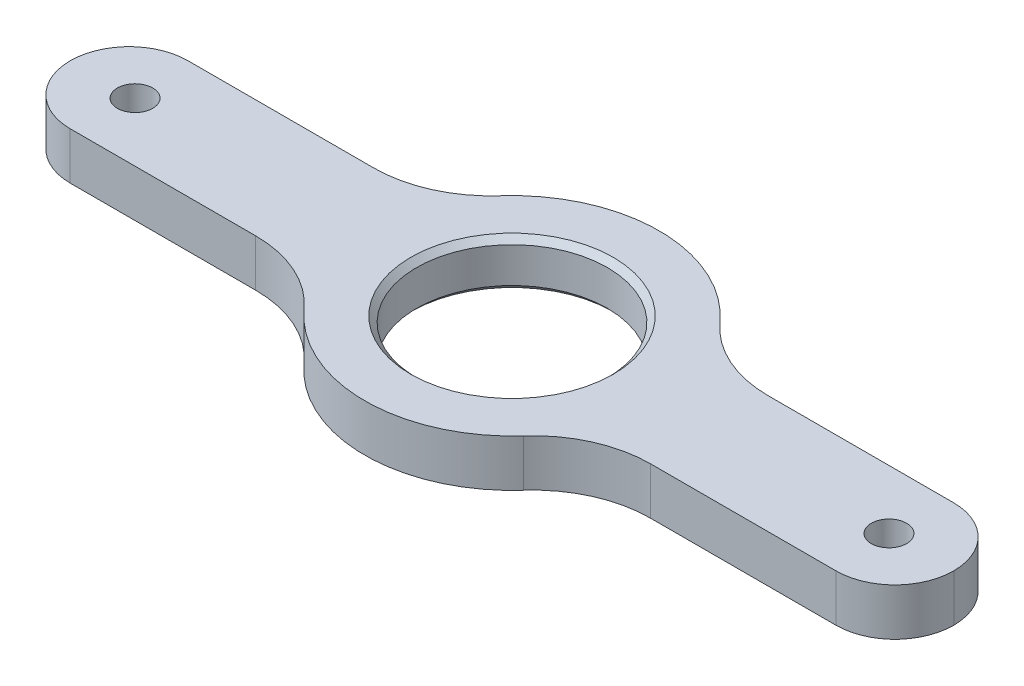
ISO-10303-21;
HEADER;
FILE_DESCRIPTION(('STEP AP214'),'2;1');
FILE_NAME('part.step','',(''),(''),'','','');
FILE_SCHEMA(('AUTOMOTIVE_DESIGN { 1 0 10303 214 1 1 1 1 }'));
ENDSEC;
DATA;
#1=APPLICATION_CONTEXT('core data for automotive mechanical design processes');
#2=APPLICATION_PROTOCOL_DEFINITION('international standard','automotive_design',2000,#1);
#3=PRODUCT_CONTEXT('',#1,'mechanical');
#4=PRODUCT('Part','Part','',(#3));
#5=PRODUCT_RELATED_PRODUCT_CATEGORY('part','',(#4));
#6=PRODUCT_DEFINITION_FORMATION('','',#4);
#7=PRODUCT_DEFINITION_CONTEXT('part definition',#1,'design');
#8=PRODUCT_DEFINITION('design','',#6,#7);
#9=PRODUCT_DEFINITION_SHAPE('','',#8);
#10=(LENGTH_UNIT() NAMED_UNIT(*) SI_UNIT(.MILLI.,.METRE.));
#11=(NAMED_UNIT(*) PLANE_ANGLE_UNIT() SI_UNIT($,.RADIAN.));
#12=(NAMED_UNIT(*) SI_UNIT($,.STERADIAN.) SOLID_ANGLE_UNIT());
#13=UNCERTAINTY_MEASURE_WITH_UNIT(LENGTH_MEASURE(1.E-05),#10,'distance_accuracy_value','');
#14=(GEOMETRIC_REPRESENTATION_CONTEXT(3) GLOBAL_UNCERTAINTY_ASSIGNED_CONTEXT((#13)) GLOBAL_UNIT_ASSIGNED_CONTEXT((#10,
#11,#12)) REPRESENTATION_CONTEXT('',''));
#15=CARTESIAN_POINT('',(0.,0.,0.));
#16=DIRECTION('',(0.,0.,1.));
#17=DIRECTION('',(1.,0.,0.));
#18=AXIS2_PLACEMENT_3D('',#15,#16,#17);
#19=CARTESIAN_POINT('',(-37.5,4.,-5.));
#20=DIRECTION('',(0.,0.,1.));
#21=DIRECTION('',(1.,0.,0.));
#22=AXIS2_PLACEMENT_3D('',#19,#20,#21);
#23=PLANE('',#22);
#24=DIRECTION('',(-1.,0.,0.));
#25=VECTOR('',#24,1.);
#26=CARTESIAN_POINT('',(-37.5,4.,-5.));
#27=LINE('',#26,#25);
#28=CARTESIAN_POINT('',(32.5,4.,-5.));
#29=VERTEX_POINT('',#28);
#30=CARTESIAN_POINT('',(16.7705098312484,4.,-5.));
#31=VERTEX_POINT('',#30);
#32=EDGE_CURVE('E163',#29,#31,#27,.T.);
#33=ORIENTED_EDGE('',*,*,#32,.F.);
#34=DIRECTION('',(0.,-1.,0.));
#35=VECTOR('',#34,1.);
#36=CARTESIAN_POINT('',(32.5,4.,-5.));
#37=LINE('',#36,#35);
#38=CARTESIAN_POINT('',(32.5,0.,-5.));
#39=VERTEX_POINT('',#38);
#40=EDGE_CURVE('E218',#29,#39,#37,.T.);
#41=ORIENTED_EDGE('',*,*,#40,.T.);
#42=DIRECTION('',(-1.,0.,0.));
#43=VECTOR('',#42,1.);
#44=CARTESIAN_POINT('',(-37.5,0.,-5.));
#45=LINE('',#44,#43);
#46=CARTESIAN_POINT('',(16.7705098312484,0.,-5.));
#47=VERTEX_POINT('',#46);
#48=EDGE_CURVE('E274',#39,#47,#45,.T.);
#49=ORIENTED_EDGE('',*,*,#48,.T.);
#50=DIRECTION('',(0.,1.,0.));
#51=VECTOR('',#50,1.);
#52=CARTESIAN_POINT('',(16.7705098312484,4.,-5.));
#53=LINE('',#52,#51);
#54=EDGE_CURVE('E178',#47,#31,#53,.T.);
#55=ORIENTED_EDGE('',*,*,#54,.T.);
#56=EDGE_LOOP('',(#33,#41,#49,#55));
#57=FACE_BOUND('',#56,.T.);
#58=ADVANCED_FACE('F39',(#57),#23,.F.);
#59=CARTESIAN_POINT('',(-37.5,4.,5.));
#60=DIRECTION('',(0.,0.,-1.));
#61=DIRECTION('',(-1.,0.,0.));
#62=AXIS2_PLACEMENT_3D('',#59,#60,#61);
#63=PLANE('',#62);
#64=DIRECTION('',(1.,0.,0.));
#65=VECTOR('',#64,1.);
#66=CARTESIAN_POINT('',(-37.5,4.,5.));
#67=LINE('',#66,#65);
#68=CARTESIAN_POINT('',(-32.5,4.,5.));
#69=VERTEX_POINT('',#68);
#70=CARTESIAN_POINT('',(-16.7705098312484,4.,5.));
#71=VERTEX_POINT('',#70);
#72=EDGE_CURVE('E162',#69,#71,#67,.T.);
#73=ORIENTED_EDGE('',*,*,#72,.F.);
#74=DIRECTION('',(0.,-1.,0.));
#75=VECTOR('',#74,1.);
#76=CARTESIAN_POINT('',(-32.5,4.,5.));
#77=LINE('',#76,#75);
#78=CARTESIAN_POINT('',(-32.5,0.,5.));
#79=VERTEX_POINT('',#78);
#80=EDGE_CURVE('E222',#69,#79,#77,.T.);
#81=ORIENTED_EDGE('',*,*,#80,.T.);
#82=DIRECTION('',(1.,0.,0.));
#83=VECTOR('',#82,1.);
#84=CARTESIAN_POINT('',(-37.5,0.,5.));
#85=LINE('',#84,#83);
#86=CARTESIAN_POINT('',(-16.7705098312484,0.,5.));
#87=VERTEX_POINT('',#86);
#88=EDGE_CURVE('E171',#79,#87,#85,.T.);
#89=ORIENTED_EDGE('',*,*,#88,.T.);
#90=DIRECTION('',(0.,1.,0.));
#91=VECTOR('',#90,1.);
#92=CARTESIAN_POINT('',(-16.7705098312484,4.,5.));
#93=LINE('',#92,#91);
#94=EDGE_CURVE('E175',#87,#71,#93,.T.);
#95=ORIENTED_EDGE('',*,*,#94,.T.);
#96=EDGE_LOOP('',(#73,#81,#89,#95));
#97=FACE_BOUND('',#96,.T.);
#98=ADVANCED_FACE('F337',(#97),#63,.F.);
#99=CARTESIAN_POINT('',(-16.7705098312484,0.,-5.));
#100=VERTEX_POINT('',#99);
#101=CARTESIAN_POINT('',(-32.5,0.,-5.));
#102=VERTEX_POINT('',#101);
#103=EDGE_CURVE('E291',#100,#102,#45,.T.);
#104=ORIENTED_EDGE('',*,*,#103,.T.);
#105=DIRECTION('',(0.,-1.,0.));
#106=VECTOR('',#105,1.);
#107=CARTESIAN_POINT('',(-32.5,4.,-5.));
#108=LINE('',#107,#106);
#109=CARTESIAN_POINT('',(-32.5,4.,-5.));
#110=VERTEX_POINT('',#109);
#111=EDGE_CURVE('E220',#102,#110,#108,.F.);
#112=ORIENTED_EDGE('',*,*,#111,.T.);
#113=CARTESIAN_POINT('',(-16.7705098312484,4.,-5.));
#114=VERTEX_POINT('',#113);
#115=EDGE_CURVE('E285',#114,#110,#27,.T.);
#116=ORIENTED_EDGE('',*,*,#115,.F.);
#117=DIRECTION('',(0.,1.,0.));
#118=VECTOR('',#117,1.);
#119=CARTESIAN_POINT('',(-16.7705098312484,4.,-5.));
#120=LINE('',#119,#118);
#121=EDGE_CURVE('E185',#114,#100,#120,.F.);
#122=ORIENTED_EDGE('',*,*,#121,.T.);
#123=EDGE_LOOP('',(#104,#112,#116,#122));
#124=FACE_BOUND('',#123,.T.);
#125=ADVANCED_FACE('F339',(#124),#23,.F.);
#126=CARTESIAN_POINT('',(16.7705098312484,0.,5.));
#127=VERTEX_POINT('',#126);
#128=CARTESIAN_POINT('',(32.5,0.,5.));
#129=VERTEX_POINT('',#128);
#130=EDGE_CURVE('E290',#127,#129,#85,.T.);
#131=ORIENTED_EDGE('',*,*,#130,.T.);
#132=DIRECTION('',(0.,-1.,0.));
#133=VECTOR('',#132,1.);
#134=CARTESIAN_POINT('',(32.5,4.,5.));
#135=LINE('',#134,#133);
#136=CARTESIAN_POINT('',(32.5,4.,5.));
#137=VERTEX_POINT('',#136);
#138=EDGE_CURVE('E161',#129,#137,#135,.F.);
#139=ORIENTED_EDGE('',*,*,#138,.T.);
#140=CARTESIAN_POINT('',(16.7705098312484,4.,5.));
#141=VERTEX_POINT('',#140);
#142=EDGE_CURVE('E144',#141,#137,#67,.T.);
#143=ORIENTED_EDGE('',*,*,#142,.F.);
#144=DIRECTION('',(0.,1.,0.));
#145=VECTOR('',#144,1.);
#146=CARTESIAN_POINT('',(16.7705098312484,4.,5.));
#147=LINE('',#146,#145);
#148=EDGE_CURVE('E158',#141,#127,#147,.F.);
#149=ORIENTED_EDGE('',*,*,#148,.T.);
#150=EDGE_LOOP('',(#131,#139,#143,#149));
#151=FACE_BOUND('',#150,.T.);
#152=ADVANCED_FACE('F157',(#151),#63,.F.);
#153=CARTESIAN_POINT('',(0.,4.,0.));
#154=DIRECTION('',(0.,-1.,0.));
#155=DIRECTION('',(0.,0.,-1.));
#156=AXIS2_PLACEMENT_3D('',#153,#154,#155);
#157=PLANE('',#156);
#158=CARTESIAN_POINT('',(0.,4.,0.));
#159=DIRECTION('',(0.,-1.,0.));
#160=DIRECTION('',(0.,0.,-1.));
#161=AXIS2_PLACEMENT_3D('',#158,#159,#160);
#162=CIRCLE('',#161,8.60000000000002);
#163=CARTESIAN_POINT('',(0.,4.,-8.60000000000002));
#164=VERTEX_POINT('',#163);
#165=EDGE_CURVE('E48',#164,#164,#162,.T.);
#166=ORIENTED_EDGE('',*,*,#165,.T.);
#167=EDGE_LOOP('',(#166));
#168=FACE_BOUND('',#167,.T.);
#169=CARTESIAN_POINT('',(32.,4.,0.));
#170=DIRECTION('',(0.,-1.,0.));
#171=DIRECTION('',(0.,0.,1.));
#172=AXIS2_PLACEMENT_3D('',#169,#170,#171);
#173=CIRCLE('',#172,1.5);
#174=CARTESIAN_POINT('',(32.,4.,1.5));
#175=VERTEX_POINT('',#174);
#176=EDGE_CURVE('E228',#175,#175,#173,.T.);
#177=ORIENTED_EDGE('',*,*,#176,.T.);
#178=EDGE_LOOP('',(#177));
#179=FACE_BOUND('',#178,.T.);
#180=CARTESIAN_POINT('',(-32.,4.,0.));
#181=DIRECTION('',(0.,1.,0.));
#182=DIRECTION('',(0.,0.,1.));
#183=AXIS2_PLACEMENT_3D('',#180,#181,#182);
#184=CIRCLE('',#183,1.5);
#185=CARTESIAN_POINT('',(-32.,4.,1.5));
#186=VERTEX_POINT('',#185);
#187=EDGE_CURVE('E308',#186,#186,#184,.T.);
#188=ORIENTED_EDGE('',*,*,#187,.F.);
#189=EDGE_LOOP('',(#188));
#190=FACE_BOUND('',#189,.T.);
#191=ORIENTED_EDGE('',*,*,#142,.T.);
#192=CARTESIAN_POINT('',(32.5,4.,0.));
#193=DIRECTION('',(0.,-1.,0.));
#194=DIRECTION('',(0.,0.,-1.));
#195=AXIS2_PLACEMENT_3D('',#192,#193,#194);
#196=CIRCLE('',#195,5.);
#197=CARTESIAN_POINT('',(37.5,4.,0.));
#198=VERTEX_POINT('',#197);
#199=EDGE_CURVE('E216',#137,#198,#196,.F.);
#200=ORIENTED_EDGE('',*,*,#199,.T.);
#201=CARTESIAN_POINT('',(32.5,4.,0.));
#202=DIRECTION('',(0.,-1.,0.));
#203=DIRECTION('',(0.,0.,-1.));
#204=AXIS2_PLACEMENT_3D('',#201,#202,#203);
#205=CIRCLE('',#204,5.);
#206=EDGE_CURVE('E214',#198,#29,#205,.F.);
#207=ORIENTED_EDGE('',*,*,#206,.T.);
#208=ORIENTED_EDGE('',*,*,#32,.T.);
#209=CARTESIAN_POINT('',(16.7705098312484,4.,-15.));
#210=DIRECTION('',(0.,-1.,0.));
#211=DIRECTION('',(0.,0.,-1.));
#212=AXIS2_PLACEMENT_3D('',#209,#210,#211);
#213=CIRCLE('',#212,10.);
#214=CARTESIAN_POINT('',(9.31694990624912,4.,-8.33333333333334));
#215=VERTEX_POINT('',#214);
#216=EDGE_CURVE('E193',#31,#215,#213,.T.);
#217=ORIENTED_EDGE('',*,*,#216,.T.);
#218=CARTESIAN_POINT('',(0.,4.,0.));
#219=DIRECTION('',(0.,1.,0.));
#220=DIRECTION('',(0.,0.,1.));
#221=AXIS2_PLACEMENT_3D('',#218,#219,#220);
#222=CIRCLE('',#221,12.5);
#223=CARTESIAN_POINT('',(-9.31694990624912,4.,-8.33333333333334));
#224=VERTEX_POINT('',#223);
#225=EDGE_CURVE('E300',#215,#224,#222,.T.);
#226=ORIENTED_EDGE('',*,*,#225,.T.);
#227=CARTESIAN_POINT('',(-16.7705098312484,4.,-15.));
#228=DIRECTION('',(0.,-1.,0.));
#229=DIRECTION('',(0.,0.,-1.));
#230=AXIS2_PLACEMENT_3D('',#227,#228,#229);
#231=CIRCLE('',#230,10.);
#232=EDGE_CURVE('E200',#224,#114,#231,.T.);
#233=ORIENTED_EDGE('',*,*,#232,.T.);
#234=ORIENTED_EDGE('',*,*,#115,.T.);
#235=CARTESIAN_POINT('',(-32.5,4.,0.));
#236=DIRECTION('',(0.,-1.,0.));
#237=DIRECTION('',(0.,0.,-1.));
#238=AXIS2_PLACEMENT_3D('',#235,#236,#237);
#239=CIRCLE('',#238,5.);
#240=CARTESIAN_POINT('',(-37.5,4.,0.));
#241=VERTEX_POINT('',#240);
#242=EDGE_CURVE('E55',#110,#241,#239,.F.);
#243=ORIENTED_EDGE('',*,*,#242,.T.);
#244=CARTESIAN_POINT('',(-32.5,4.,0.));
#245=DIRECTION('',(0.,-1.,0.));
#246=DIRECTION('',(0.,0.,-1.));
#247=AXIS2_PLACEMENT_3D('',#244,#245,#246);
#248=CIRCLE('',#247,5.);
#249=EDGE_CURVE('E211',#241,#69,#248,.F.);
#250=ORIENTED_EDGE('',*,*,#249,.T.);
#251=ORIENTED_EDGE('',*,*,#72,.T.);
#252=CARTESIAN_POINT('',(-16.7705098312484,4.,15.));
#253=DIRECTION('',(0.,-1.,0.));
#254=DIRECTION('',(0.,0.,-1.));
#255=AXIS2_PLACEMENT_3D('',#252,#253,#254);
#256=CIRCLE('',#255,10.);
#257=CARTESIAN_POINT('',(-9.31694990624913,4.,8.33333333333333));
#258=VERTEX_POINT('',#257);
#259=EDGE_CURVE('E150',#71,#258,#256,.T.);
#260=ORIENTED_EDGE('',*,*,#259,.T.);
#261=CARTESIAN_POINT('',(9.31694990624913,4.,8.33333333333333));
#262=VERTEX_POINT('',#261);
#263=EDGE_CURVE('E146',#258,#262,#222,.T.);
#264=ORIENTED_EDGE('',*,*,#263,.T.);
#265=CARTESIAN_POINT('',(16.7705098312484,4.,15.));
#266=DIRECTION('',(0.,-1.,0.));
#267=DIRECTION('',(0.,0.,-1.));
#268=AXIS2_PLACEMENT_3D('',#265,#266,#267);
#269=CIRCLE('',#268,10.);
#270=EDGE_CURVE('E141',#262,#141,#269,.T.);
#271=ORIENTED_EDGE('',*,*,#270,.T.);
#272=EDGE_LOOP('',(#191,#200,#207,#208,#217,#226,#233,#234,#243,#250,#251,#260,#264,#271));
#273=FACE_BOUND('',#272,.T.);
#274=ADVANCED_FACE('F143',(#168,#179,#190,#273),#157,.F.);
#275=CARTESIAN_POINT('',(0.,0.,0.));
#276=DIRECTION('',(0.,-1.,0.));
#277=DIRECTION('',(0.,0.,-1.));
#278=AXIS2_PLACEMENT_3D('',#275,#276,#277);
#279=PLANE('',#278);
#280=CARTESIAN_POINT('',(0.,0.,0.));
#281=DIRECTION('',(0.,-1.,0.));
#282=DIRECTION('',(0.,0.,-1.));
#283=AXIS2_PLACEMENT_3D('',#280,#281,#282);
#284=CIRCLE('',#283,8.60000000000001);
#285=CARTESIAN_POINT('',(0.,0.,-8.60000000000001));
#286=VERTEX_POINT('',#285);
#287=EDGE_CURVE('E11',#286,#286,#284,.F.);
#288=ORIENTED_EDGE('',*,*,#287,.T.);
#289=EDGE_LOOP('',(#288));
#290=FACE_BOUND('',#289,.T.);
#291=CARTESIAN_POINT('',(32.,0.,0.));
#292=DIRECTION('',(0.,-1.,0.));
#293=DIRECTION('',(0.,0.,1.));
#294=AXIS2_PLACEMENT_3D('',#291,#292,#293);
#295=CIRCLE('',#294,1.5);
#296=CARTESIAN_POINT('',(32.,0.,1.5));
#297=VERTEX_POINT('',#296);
#298=EDGE_CURVE('E265',#297,#297,#295,.T.);
#299=ORIENTED_EDGE('',*,*,#298,.F.);
#300=EDGE_LOOP('',(#299));
#301=FACE_BOUND('',#300,.T.);
#302=CARTESIAN_POINT('',(-32.,0.,0.));
#303=DIRECTION('',(0.,1.,0.));
#304=DIRECTION('',(0.,0.,1.));
#305=AXIS2_PLACEMENT_3D('',#302,#303,#304);
#306=CIRCLE('',#305,1.5);
#307=CARTESIAN_POINT('',(-32.,0.,1.5));
#308=VERTEX_POINT('',#307);
#309=EDGE_CURVE('E269',#308,#308,#306,.T.);
#310=ORIENTED_EDGE('',*,*,#309,.T.);
#311=EDGE_LOOP('',(#310));
#312=FACE_BOUND('',#311,.T.);
#313=CARTESIAN_POINT('',(32.5,0.,0.));
#314=DIRECTION('',(0.,-1.,0.));
#315=DIRECTION('',(0.,0.,-1.));
#316=AXIS2_PLACEMENT_3D('',#313,#314,#315);
#317=CIRCLE('',#316,5.);
#318=CARTESIAN_POINT('',(37.5,0.,0.));
#319=VERTEX_POINT('',#318);
#320=EDGE_CURVE('E206',#39,#319,#317,.T.);
#321=ORIENTED_EDGE('',*,*,#320,.T.);
#322=CARTESIAN_POINT('',(32.5,0.,0.));
#323=DIRECTION('',(0.,-1.,0.));
#324=DIRECTION('',(0.,0.,-1.));
#325=AXIS2_PLACEMENT_3D('',#322,#323,#324);
#326=CIRCLE('',#325,5.);
#327=EDGE_CURVE('E208',#319,#129,#326,.T.);
#328=ORIENTED_EDGE('',*,*,#327,.T.);
#329=ORIENTED_EDGE('',*,*,#130,.F.);
#330=CARTESIAN_POINT('',(16.7705098312484,0.,15.));
#331=DIRECTION('',(0.,-1.,0.));
#332=DIRECTION('',(0.,0.,-1.));
#333=AXIS2_PLACEMENT_3D('',#330,#331,#332);
#334=CIRCLE('',#333,10.);
#335=CARTESIAN_POINT('',(9.31694990624913,0.,8.33333333333333));
#336=VERTEX_POINT('',#335);
#337=EDGE_CURVE('E151',#127,#336,#334,.F.);
#338=ORIENTED_EDGE('',*,*,#337,.T.);
#339=CARTESIAN_POINT('',(0.,0.,0.));
#340=DIRECTION('',(0.,-1.,0.));
#341=DIRECTION('',(0.,0.,-1.));
#342=AXIS2_PLACEMENT_3D('',#339,#340,#341);
#343=CIRCLE('',#342,12.5);
#344=CARTESIAN_POINT('',(-9.31694990624913,0.,8.33333333333333));
#345=VERTEX_POINT('',#344);
#346=EDGE_CURVE('E293',#345,#336,#343,.F.);
#347=ORIENTED_EDGE('',*,*,#346,.F.);
#348=CARTESIAN_POINT('',(-16.7705098312484,0.,15.));
#349=DIRECTION('',(0.,-1.,0.));
#350=DIRECTION('',(0.,0.,-1.));
#351=AXIS2_PLACEMENT_3D('',#348,#349,#350);
#352=CIRCLE('',#351,10.);
#353=EDGE_CURVE('E190',#345,#87,#352,.F.);
#354=ORIENTED_EDGE('',*,*,#353,.T.);
#355=ORIENTED_EDGE('',*,*,#88,.F.);
#356=CARTESIAN_POINT('',(-32.5,0.,0.));
#357=DIRECTION('',(0.,-1.,0.));
#358=DIRECTION('',(0.,0.,-1.));
#359=AXIS2_PLACEMENT_3D('',#356,#357,#358);
#360=CIRCLE('',#359,5.);
#361=CARTESIAN_POINT('',(-37.5,0.,0.));
#362=VERTEX_POINT('',#361);
#363=EDGE_CURVE('E202',#79,#362,#360,.T.);
#364=ORIENTED_EDGE('',*,*,#363,.T.);
#365=CARTESIAN_POINT('',(-32.5,0.,0.));
#366=DIRECTION('',(0.,-1.,0.));
#367=DIRECTION('',(0.,0.,-1.));
#368=AXIS2_PLACEMENT_3D('',#365,#366,#367);
#369=CIRCLE('',#368,5.);
#370=EDGE_CURVE('E204',#362,#102,#369,.T.);
#371=ORIENTED_EDGE('',*,*,#370,.T.);
#372=ORIENTED_EDGE('',*,*,#103,.F.);
#373=CARTESIAN_POINT('',(-16.7705098312484,0.,-15.));
#374=DIRECTION('',(0.,-1.,0.));
#375=DIRECTION('',(0.,0.,-1.));
#376=AXIS2_PLACEMENT_3D('',#373,#374,#375);
#377=CIRCLE('',#376,10.);
#378=CARTESIAN_POINT('',(-9.31694990624912,0.,-8.33333333333334));
#379=VERTEX_POINT('',#378);
#380=EDGE_CURVE('E198',#100,#379,#377,.F.);
#381=ORIENTED_EDGE('',*,*,#380,.T.);
#382=CARTESIAN_POINT('',(9.31694990624912,0.,-8.33333333333334));
#383=VERTEX_POINT('',#382);
#384=EDGE_CURVE('E288',#383,#379,#343,.F.);
#385=ORIENTED_EDGE('',*,*,#384,.F.);
#386=CARTESIAN_POINT('',(16.7705098312484,0.,-15.));
#387=DIRECTION('',(0.,-1.,0.));
#388=DIRECTION('',(0.,0.,-1.));
#389=AXIS2_PLACEMENT_3D('',#386,#387,#388);
#390=CIRCLE('',#389,10.);
#391=EDGE_CURVE('E195',#383,#47,#390,.F.);
#392=ORIENTED_EDGE('',*,*,#391,.T.);
#393=ORIENTED_EDGE('',*,*,#48,.F.);
#394=EDGE_LOOP('',(#321,#328,#329,#338,#347,#354,#355,#364,#371,#372,#381,#385,#392,#393));
#395=FACE_BOUND('',#394,.T.);
#396=ADVANCED_FACE('F257',(#290,#301,#312,#395),#279,.T.);
#397=CARTESIAN_POINT('',(0.,-35.3553390593274,0.));
#398=DIRECTION('',(0.,1.,0.));
#399=DIRECTION('',(0.,0.,1.));
#400=AXIS2_PLACEMENT_3D('',#397,#398,#399);
#401=CYLINDRICAL_SURFACE('',#400,12.5);
#402=ORIENTED_EDGE('',*,*,#346,.T.);
#403=DIRECTION('',(0.,1.,0.));
#404=VECTOR('',#403,1.);
#405=CARTESIAN_POINT('',(9.31694990624913,-35.3553390593274,8.33333333333333));
#406=LINE('',#405,#404);
#407=EDGE_CURVE('E168',#336,#262,#406,.T.);
#408=ORIENTED_EDGE('',*,*,#407,.T.);
#409=ORIENTED_EDGE('',*,*,#263,.F.);
#410=DIRECTION('',(0.,1.,0.));
#411=VECTOR('',#410,1.);
#412=CARTESIAN_POINT('',(-9.31694990624913,-35.3553390593274,8.33333333333333));
#413=LINE('',#412,#411);
#414=EDGE_CURVE('E166',#258,#345,#413,.F.);
#415=ORIENTED_EDGE('',*,*,#414,.T.);
#416=EDGE_LOOP('',(#402,#408,#409,#415));
#417=FACE_BOUND('',#416,.T.);
#418=ADVANCED_FACE('F260',(#417),#401,.T.);
#419=ORIENTED_EDGE('',*,*,#225,.F.);
#420=DIRECTION('',(0.,1.,0.));
#421=VECTOR('',#420,1.);
#422=CARTESIAN_POINT('',(9.31694990624912,-35.3553390593274,-8.33333333333334));
#423=LINE('',#422,#421);
#424=EDGE_CURVE('E183',#215,#383,#423,.F.);
#425=ORIENTED_EDGE('',*,*,#424,.T.);
#426=ORIENTED_EDGE('',*,*,#384,.T.);
#427=DIRECTION('',(0.,1.,0.));
#428=VECTOR('',#427,1.);
#429=CARTESIAN_POINT('',(-9.31694990624912,-35.3553390593274,-8.33333333333334));
#430=LINE('',#429,#428);
#431=EDGE_CURVE('E181',#379,#224,#430,.T.);
#432=ORIENTED_EDGE('',*,*,#431,.T.);
#433=EDGE_LOOP('',(#419,#425,#426,#432));
#434=FACE_BOUND('',#433,.T.);
#435=ADVANCED_FACE('F249',(#434),#401,.T.);
#436=CARTESIAN_POINT('',(0.,0.,0.));
#437=DIRECTION('',(0.,1.,0.));
#438=DIRECTION('',(0.,0.,1.));
#439=AXIS2_PLACEMENT_3D('',#436,#437,#438);
#440=CYLINDRICAL_SURFACE('',#439,8.1);
#441=CARTESIAN_POINT('',(0.,3.49999999999998,0.));
#442=DIRECTION('',(0.,-1.,0.));
#443=DIRECTION('',(0.,0.,-1.));
#444=AXIS2_PLACEMENT_3D('',#441,#442,#443);
#445=CIRCLE('',#444,8.1);
#446=CARTESIAN_POINT('',(0.,3.49999999999998,-8.1));
#447=VERTEX_POINT('',#446);
#448=EDGE_CURVE('E233',#447,#447,#445,.F.);
#449=ORIENTED_EDGE('',*,*,#448,.T.);
#450=EDGE_LOOP('',(#449));
#451=FACE_BOUND('',#450,.T.);
#452=CARTESIAN_POINT('',(0.,0.500000000000018,0.));
#453=DIRECTION('',(0.,-1.,0.));
#454=DIRECTION('',(0.,0.,-1.));
#455=AXIS2_PLACEMENT_3D('',#452,#453,#454);
#456=CIRCLE('',#455,8.1);
#457=CARTESIAN_POINT('',(0.,0.500000000000018,-8.1));
#458=VERTEX_POINT('',#457);
#459=EDGE_CURVE('E224',#458,#458,#456,.T.);
#460=ORIENTED_EDGE('',*,*,#459,.T.);
#461=EDGE_LOOP('',(#460));
#462=FACE_BOUND('',#461,.T.);
#463=ADVANCED_FACE('F246',(#451,#462),#440,.F.);
#464=CARTESIAN_POINT('',(16.7705098312484,-35.3553390593274,15.));
#465=DIRECTION('',(0.,1.,0.));
#466=DIRECTION('',(0.,0.,1.));
#467=AXIS2_PLACEMENT_3D('',#464,#465,#466);
#468=CYLINDRICAL_SURFACE('',#467,10.);
#469=ORIENTED_EDGE('',*,*,#270,.F.);
#470=ORIENTED_EDGE('',*,*,#407,.F.);
#471=ORIENTED_EDGE('',*,*,#337,.F.);
#472=ORIENTED_EDGE('',*,*,#148,.F.);
#473=EDGE_LOOP('',(#469,#470,#471,#472));
#474=FACE_BOUND('',#473,.T.);
#475=ADVANCED_FACE('F165',(#474),#468,.F.);
#476=CARTESIAN_POINT('',(-16.7705098312484,-35.3553390593274,15.));
#477=DIRECTION('',(0.,1.,0.));
#478=DIRECTION('',(0.,0.,1.));
#479=AXIS2_PLACEMENT_3D('',#476,#477,#478);
#480=CYLINDRICAL_SURFACE('',#479,10.);
#481=ORIENTED_EDGE('',*,*,#353,.F.);
#482=ORIENTED_EDGE('',*,*,#414,.F.);
#483=ORIENTED_EDGE('',*,*,#259,.F.);
#484=ORIENTED_EDGE('',*,*,#94,.F.);
#485=EDGE_LOOP('',(#481,#482,#483,#484));
#486=FACE_BOUND('',#485,.T.);
#487=ADVANCED_FACE('F374',(#486),#480,.F.);
#488=CARTESIAN_POINT('',(16.7705098312484,-35.3553390593274,-15.));
#489=DIRECTION('',(0.,1.,0.));
#490=DIRECTION('',(0.,0.,1.));
#491=AXIS2_PLACEMENT_3D('',#488,#489,#490);
#492=CYLINDRICAL_SURFACE('',#491,10.);
#493=ORIENTED_EDGE('',*,*,#391,.F.);
#494=ORIENTED_EDGE('',*,*,#424,.F.);
#495=ORIENTED_EDGE('',*,*,#216,.F.);
#496=ORIENTED_EDGE('',*,*,#54,.F.);
#497=EDGE_LOOP('',(#493,#494,#495,#496));
#498=FACE_BOUND('',#497,.T.);
#499=ADVANCED_FACE('F333',(#498),#492,.F.);
#500=CARTESIAN_POINT('',(-16.7705098312484,-35.3553390593274,-15.));
#501=DIRECTION('',(0.,1.,0.));
#502=DIRECTION('',(0.,0.,1.));
#503=AXIS2_PLACEMENT_3D('',#500,#501,#502);
#504=CYLINDRICAL_SURFACE('',#503,10.);
#505=ORIENTED_EDGE('',*,*,#232,.F.);
#506=ORIENTED_EDGE('',*,*,#431,.F.);
#507=ORIENTED_EDGE('',*,*,#380,.F.);
#508=ORIENTED_EDGE('',*,*,#121,.F.);
#509=EDGE_LOOP('',(#505,#506,#507,#508));
#510=FACE_BOUND('',#509,.T.);
#511=ADVANCED_FACE('F327',(#510),#504,.F.);
#512=CARTESIAN_POINT('',(-32.,0.,0.));
#513=DIRECTION('',(0.,1.,0.));
#514=DIRECTION('',(0.,0.,1.));
#515=AXIS2_PLACEMENT_3D('',#512,#513,#514);
#516=CYLINDRICAL_SURFACE('',#515,1.5);
#517=ORIENTED_EDGE('',*,*,#309,.F.);
#518=EDGE_LOOP('',(#517));
#519=FACE_BOUND('',#518,.T.);
#520=ORIENTED_EDGE('',*,*,#187,.T.);
#521=EDGE_LOOP('',(#520));
#522=FACE_BOUND('',#521,.T.);
#523=ADVANCED_FACE('F318',(#519,#522),#516,.F.);
#524=CARTESIAN_POINT('',(32.,0.,0.));
#525=DIRECTION('',(0.,1.,0.));
#526=DIRECTION('',(0.,0.,1.));
#527=AXIS2_PLACEMENT_3D('',#524,#525,#526);
#528=CYLINDRICAL_SURFACE('',#527,1.5);
#529=ORIENTED_EDGE('',*,*,#298,.T.);
#530=EDGE_LOOP('',(#529));
#531=FACE_BOUND('',#530,.T.);
#532=ORIENTED_EDGE('',*,*,#176,.F.);
#533=EDGE_LOOP('',(#532));
#534=FACE_BOUND('',#533,.T.);
#535=ADVANCED_FACE('F315',(#531,#534),#528,.F.);
#536=CARTESIAN_POINT('',(32.5,4.,0.));
#537=DIRECTION('',(0.,-1.,0.));
#538=DIRECTION('',(0.,0.,-1.));
#539=AXIS2_PLACEMENT_3D('',#536,#537,#538);
#540=CYLINDRICAL_SURFACE('',#539,5.);
#541=ORIENTED_EDGE('',*,*,#40,.F.);
#542=ORIENTED_EDGE('',*,*,#206,.F.);
#543=DIRECTION('',(0.,-1.,0.));
#544=VECTOR('',#543,1.);
#545=CARTESIAN_POINT('',(37.5,4.,0.));
#546=LINE('',#545,#544);
#547=EDGE_CURVE('E225',#319,#198,#546,.F.);
#548=ORIENTED_EDGE('',*,*,#547,.F.);
#549=ORIENTED_EDGE('',*,*,#320,.F.);
#550=EDGE_LOOP('',(#541,#542,#548,#549));
#551=FACE_BOUND('',#550,.T.);
#552=ADVANCED_FACE('F278',(#551),#540,.T.);
#553=CARTESIAN_POINT('',(32.5,4.,0.));
#554=DIRECTION('',(0.,-1.,0.));
#555=DIRECTION('',(0.,0.,-1.));
#556=AXIS2_PLACEMENT_3D('',#553,#554,#555);
#557=CYLINDRICAL_SURFACE('',#556,5.);
#558=ORIENTED_EDGE('',*,*,#199,.F.);
#559=ORIENTED_EDGE('',*,*,#138,.F.);
#560=ORIENTED_EDGE('',*,*,#327,.F.);
#561=ORIENTED_EDGE('',*,*,#547,.T.);
#562=EDGE_LOOP('',(#558,#559,#560,#561));
#563=FACE_BOUND('',#562,.T.);
#564=ADVANCED_FACE('F280',(#563),#557,.T.);
#565=CARTESIAN_POINT('',(-32.5,4.,0.));
#566=DIRECTION('',(0.,-1.,0.));
#567=DIRECTION('',(0.,0.,-1.));
#568=AXIS2_PLACEMENT_3D('',#565,#566,#567);
#569=CYLINDRICAL_SURFACE('',#568,5.);
#570=ORIENTED_EDGE('',*,*,#80,.F.);
#571=ORIENTED_EDGE('',*,*,#249,.F.);
#572=DIRECTION('',(0.,-1.,0.));
#573=VECTOR('',#572,1.);
#574=CARTESIAN_POINT('',(-37.5,4.,0.));
#575=LINE('',#574,#573);
#576=EDGE_CURVE('E229',#362,#241,#575,.F.);
#577=ORIENTED_EDGE('',*,*,#576,.F.);
#578=ORIENTED_EDGE('',*,*,#363,.F.);
#579=EDGE_LOOP('',(#570,#571,#577,#578));
#580=FACE_BOUND('',#579,.T.);
#581=ADVANCED_FACE('F368',(#580),#569,.T.);
#582=CARTESIAN_POINT('',(-32.5,4.,0.));
#583=DIRECTION('',(0.,-1.,0.));
#584=DIRECTION('',(0.,0.,-1.));
#585=AXIS2_PLACEMENT_3D('',#582,#583,#584);
#586=CYLINDRICAL_SURFACE('',#585,5.);
#587=ORIENTED_EDGE('',*,*,#242,.F.);
#588=ORIENTED_EDGE('',*,*,#111,.F.);
#589=ORIENTED_EDGE('',*,*,#370,.F.);
#590=ORIENTED_EDGE('',*,*,#576,.T.);
#591=EDGE_LOOP('',(#587,#588,#589,#590));
#592=FACE_BOUND('',#591,.T.);
#593=ADVANCED_FACE('F243',(#592),#586,.T.);
#594=CARTESIAN_POINT('',(0.,3.49999999999998,0.));
#595=DIRECTION('',(0.,1.,0.));
#596=DIRECTION('',(0.,0.,1.));
#597=AXIS2_PLACEMENT_3D('',#594,#595,#596);
#598=CONICAL_SURFACE('',#597,8.1,0.785398163397448);
#599=ORIENTED_EDGE('',*,*,#165,.F.);
#600=EDGE_LOOP('',(#599));
#601=FACE_BOUND('',#600,.T.);
#602=ORIENTED_EDGE('',*,*,#448,.F.);
#603=EDGE_LOOP('',(#602));
#604=FACE_BOUND('',#603,.T.);
#605=ADVANCED_FACE('F240',(#601,#604),#598,.F.);
#606=CARTESIAN_POINT('',(0.,0.,0.));
#607=DIRECTION('',(0.,-1.,0.));
#608=DIRECTION('',(0.,0.,-1.));
#609=AXIS2_PLACEMENT_3D('',#606,#607,#608);
#610=CONICAL_SURFACE('',#609,8.60000000000001,0.785398163397441);
#611=ORIENTED_EDGE('',*,*,#459,.F.);
#612=EDGE_LOOP('',(#611));
#613=FACE_BOUND('',#612,.T.);
#614=ORIENTED_EDGE('',*,*,#287,.F.);
#615=EDGE_LOOP('',(#614));
#616=FACE_BOUND('',#615,.T.);
#617=ADVANCED_FACE('F42',(#613,#616),#610,.F.);
#618=CLOSED_SHELL('',(#58,#98,#125,#152,#274,#396,#418,#435,#463,#475,#487,#499,#511,#523,#535,
#552,#564,#581,#593,#605,#617));
#619=MANIFOLD_SOLID_BREP('B2',#618);
#620=ADVANCED_BREP_SHAPE_REPRESENTATION('',(#18,#619),#14);
#621=SHAPE_DEFINITION_REPRESENTATION(#9,#620);
ENDSEC;
END-ISO-10303-21;
